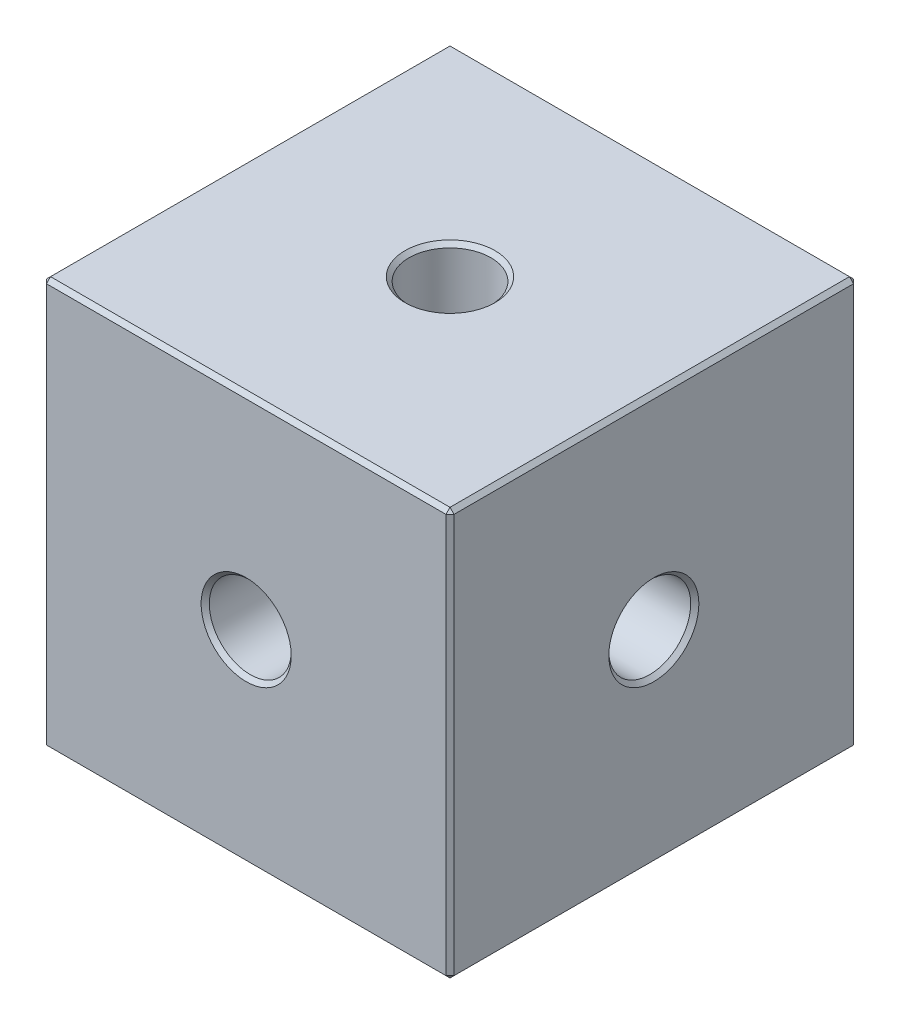
ISO-10303-21;
HEADER;
FILE_DESCRIPTION(('STEP AP214'),'2;1');
FILE_NAME('part.step','',(''),(''),'','','');
FILE_SCHEMA(('AUTOMOTIVE_DESIGN { 1 0 10303 214 1 1 1 1 }'));
ENDSEC;
DATA;
#1=APPLICATION_CONTEXT('core data for automotive mechanical design processes');
#2=APPLICATION_PROTOCOL_DEFINITION('international standard','automotive_design',2000,#1);
#3=PRODUCT_CONTEXT('',#1,'mechanical');
#4=PRODUCT('Part','Part','',(#3));
#5=PRODUCT_RELATED_PRODUCT_CATEGORY('part','',(#4));
#6=PRODUCT_DEFINITION_FORMATION('','',#4);
#7=PRODUCT_DEFINITION_CONTEXT('part definition',#1,'design');
#8=PRODUCT_DEFINITION('design','',#6,#7);
#9=PRODUCT_DEFINITION_SHAPE('','',#8);
#10=(LENGTH_UNIT() NAMED_UNIT(*) SI_UNIT(.MILLI.,.METRE.));
#11=(NAMED_UNIT(*) PLANE_ANGLE_UNIT() SI_UNIT($,.RADIAN.));
#12=(NAMED_UNIT(*) SI_UNIT($,.STERADIAN.) SOLID_ANGLE_UNIT());
#13=UNCERTAINTY_MEASURE_WITH_UNIT(LENGTH_MEASURE(1.E-05),#10,'distance_accuracy_value','');
#14=(GEOMETRIC_REPRESENTATION_CONTEXT(3) GLOBAL_UNCERTAINTY_ASSIGNED_CONTEXT((#13)) GLOBAL_UNIT_ASSIGNED_CONTEXT((#10,
#11,#12)) REPRESENTATION_CONTEXT('',''));
#15=CARTESIAN_POINT('',(0.,0.,0.));
#16=DIRECTION('',(0.,0.,1.));
#17=DIRECTION('',(1.,0.,0.));
#18=AXIS2_PLACEMENT_3D('',#15,#16,#17);
#19=CARTESIAN_POINT('',(-33.5101830116808,19.0472283906615,11.4440779123584));
#20=DIRECTION('',(1.,0.,0.));
#21=DIRECTION('',(0.,0.,-1.));
#22=AXIS2_PLACEMENT_3D('',#19,#20,#21);
#23=CYLINDRICAL_SURFACE('',#22,2.55269999999999);
#24=CARTESIAN_POINT('',(-33.7641830116808,19.0472283906615,11.4440779123584));
#25=DIRECTION('',(1.,0.,0.));
#26=DIRECTION('',(0.,0.,-1.));
#27=AXIS2_PLACEMENT_3D('',#24,#25,#26);
#28=CIRCLE('',#27,2.55269999999999);
#29=CARTESIAN_POINT('',(-33.7641830116808,19.0472283906615,8.89137791235836));
#30=VERTEX_POINT('',#29);
#31=EDGE_CURVE('E25',#30,#30,#28,.T.);
#32=ORIENTED_EDGE('',*,*,#31,.T.);
#33=EDGE_LOOP('',(#32));
#34=FACE_BOUND('',#33,.T.);
#35=CARTESIAN_POINT('',(-46.2101830116808,19.0472283906615,11.4440779123584));
#36=DIRECTION('',(0.707106781186547,-0.707106781186547,0.));
#37=DIRECTION('',(0.707106781186547,0.707106781186547,0.));
#38=AXIS2_PLACEMENT_3D('',#35,#36,#37);
#39=ELLIPSE('',#38,3.61006296066979,2.55269999999999);
#40=CARTESIAN_POINT('',(-44.4051515313459,20.8522598709964,13.2491093926932));
#41=VERTEX_POINT('',#40);
#42=CARTESIAN_POINT('',(-44.4051515313459,20.8522598709964,9.63904643202346));
#43=VERTEX_POINT('',#42);
#44=EDGE_CURVE('E152',#41,#43,#39,.F.);
#45=ORIENTED_EDGE('',*,*,#44,.T.);
#46=CARTESIAN_POINT('',(-46.2101830116808,19.0472283906615,11.4440779123584));
#47=DIRECTION('',(0.707106781186547,0.,0.707106781186547));
#48=DIRECTION('',(0.707106781186547,0.,-0.707106781186547));
#49=AXIS2_PLACEMENT_3D('',#46,#47,#48);
#50=ELLIPSE('',#49,3.61006296066979,2.55269999999999);
#51=CARTESIAN_POINT('',(-44.4051515313459,17.2421969103266,9.63904643202346));
#52=VERTEX_POINT('',#51);
#53=EDGE_CURVE('E136',#43,#52,#50,.F.);
#54=ORIENTED_EDGE('',*,*,#53,.T.);
#55=CARTESIAN_POINT('',(-46.2101830116808,19.0472283906615,11.4440779123584));
#56=DIRECTION('',(0.707106781186547,0.707106781186547,0.));
#57=DIRECTION('',(0.707106781186547,-0.707106781186547,0.));
#58=AXIS2_PLACEMENT_3D('',#55,#56,#57);
#59=ELLIPSE('',#58,3.61006296066979,2.55269999999999);
#60=CARTESIAN_POINT('',(-44.4051515313459,17.2421969103266,13.2491093926932));
#61=VERTEX_POINT('',#60);
#62=EDGE_CURVE('E145',#52,#61,#59,.F.);
#63=ORIENTED_EDGE('',*,*,#62,.T.);
#64=CARTESIAN_POINT('',(-46.2101830116808,19.0472283906615,11.4440779123584));
#65=DIRECTION('',(0.707106781186547,0.,-0.707106781186547));
#66=DIRECTION('',(0.707106781186547,0.,0.707106781186547));
#67=AXIS2_PLACEMENT_3D('',#64,#65,#66);
#68=ELLIPSE('',#67,3.61006296066979,2.55269999999999);
#69=EDGE_CURVE('E325',#61,#41,#68,.F.);
#70=ORIENTED_EDGE('',*,*,#69,.T.);
#71=EDGE_LOOP('',(#45,#54,#63,#70));
#72=FACE_BOUND('',#71,.T.);
#73=ADVANCED_FACE('F16',(#34,#72),#23,.F.);
#74=CARTESIAN_POINT('',(-58.9101830116808,6.34722839066153,24.1440779123584));
#75=DIRECTION('',(-1.,0.,0.));
#76=DIRECTION('',(0.,0.,1.));
#77=AXIS2_PLACEMENT_3D('',#74,#75,#76);
#78=PLANE('',#77);
#79=DIRECTION('',(0.,1.,0.));
#80=VECTOR('',#79,1.);
#81=CARTESIAN_POINT('',(-58.9101830116808,6.34722839066153,23.8900779123583));
#82=LINE('',#81,#80);
#83=CARTESIAN_POINT('',(-58.9101830116808,6.60122839066154,23.8900779123583));
#84=VERTEX_POINT('',#83);
#85=CARTESIAN_POINT('',(-58.9101830116808,31.4932283906615,23.8900779123583));
#86=VERTEX_POINT('',#85);
#87=EDGE_CURVE('E208',#84,#86,#82,.T.);
#88=ORIENTED_EDGE('',*,*,#87,.T.);
#89=DIRECTION('',(0.,0.,-1.));
#90=VECTOR('',#89,1.);
#91=CARTESIAN_POINT('',(-58.9101830116808,31.4932283906615,-1.25592208764165));
#92=LINE('',#91,#90);
#93=CARTESIAN_POINT('',(-58.9101830116808,31.4932283906615,-1.00192208764164));
#94=VERTEX_POINT('',#93);
#95=EDGE_CURVE('E210',#86,#94,#92,.T.);
#96=ORIENTED_EDGE('',*,*,#95,.T.);
#97=DIRECTION('',(0.,-1.,0.));
#98=VECTOR('',#97,1.);
#99=CARTESIAN_POINT('',(-58.9101830116808,6.34722839066153,-1.00192208764164));
#100=LINE('',#99,#98);
#101=CARTESIAN_POINT('',(-58.9101830116808,6.60122839066154,-1.00192208764164));
#102=VERTEX_POINT('',#101);
#103=EDGE_CURVE('E204',#94,#102,#100,.T.);
#104=ORIENTED_EDGE('',*,*,#103,.T.);
#105=DIRECTION('',(0.,0.,1.));
#106=VECTOR('',#105,1.);
#107=CARTESIAN_POINT('',(-58.9101830116808,6.60122839066154,24.1440779123584));
#108=LINE('',#107,#106);
#109=EDGE_CURVE('E206',#102,#84,#108,.T.);
#110=ORIENTED_EDGE('',*,*,#109,.T.);
#111=EDGE_LOOP('',(#88,#96,#104,#110));
#112=FACE_BOUND('',#111,.T.);
#113=CARTESIAN_POINT('',(-58.9101830116808,19.0472283906615,11.4440779123584));
#114=DIRECTION('',(-1.,0.,0.));
#115=DIRECTION('',(0.,0.,1.));
#116=AXIS2_PLACEMENT_3D('',#113,#114,#115);
#117=CIRCLE('',#116,2.80669999999999);
#118=CARTESIAN_POINT('',(-58.9101830116808,19.0472283906615,14.2507779123583));
#119=VERTEX_POINT('',#118);
#120=EDGE_CURVE('E201',#119,#119,#117,.F.);
#121=ORIENTED_EDGE('',*,*,#120,.T.);
#122=EDGE_LOOP('',(#121));
#123=FACE_BOUND('',#122,.T.);
#124=ADVANCED_FACE('F349',(#112,#123),#78,.T.);
#125=CARTESIAN_POINT('',(-58.9101830116808,6.34722839066153,-1.25592208764165));
#126=DIRECTION('',(0.,0.,-1.));
#127=DIRECTION('',(-1.,0.,0.));
#128=AXIS2_PLACEMENT_3D('',#125,#126,#127);
#129=PLANE('',#128);
#130=DIRECTION('',(1.,0.,0.));
#131=VECTOR('',#130,1.);
#132=CARTESIAN_POINT('',(-33.5101830116808,31.4932283906615,-1.25592208764165));
#133=LINE('',#132,#131);
#134=CARTESIAN_POINT('',(-58.6561830116808,31.4932283906615,-1.25592208764165));
#135=VERTEX_POINT('',#134);
#136=CARTESIAN_POINT('',(-33.7641830116808,31.4932283906615,-1.25592208764165));
#137=VERTEX_POINT('',#136);
#138=EDGE_CURVE('E196',#135,#137,#133,.T.);
#139=ORIENTED_EDGE('',*,*,#138,.T.);
#140=DIRECTION('',(0.,-1.,0.));
#141=VECTOR('',#140,1.);
#142=CARTESIAN_POINT('',(-33.7641830116808,6.34722839066153,-1.25592208764165));
#143=LINE('',#142,#141);
#144=CARTESIAN_POINT('',(-33.7641830116808,6.60122839066154,-1.25592208764165));
#145=VERTEX_POINT('',#144);
#146=EDGE_CURVE('E198',#137,#145,#143,.T.);
#147=ORIENTED_EDGE('',*,*,#146,.T.);
#148=DIRECTION('',(-1.,0.,0.));
#149=VECTOR('',#148,1.);
#150=CARTESIAN_POINT('',(-58.9101830116808,6.60122839066154,-1.25592208764165));
#151=LINE('',#150,#149);
#152=CARTESIAN_POINT('',(-58.6561830116808,6.60122839066154,-1.25592208764165));
#153=VERTEX_POINT('',#152);
#154=EDGE_CURVE('E192',#145,#153,#151,.T.);
#155=ORIENTED_EDGE('',*,*,#154,.T.);
#156=DIRECTION('',(0.,1.,0.));
#157=VECTOR('',#156,1.);
#158=CARTESIAN_POINT('',(-58.6561830116808,6.34722839066153,-1.25592208764165));
#159=LINE('',#158,#157);
#160=EDGE_CURVE('E194',#153,#135,#159,.T.);
#161=ORIENTED_EDGE('',*,*,#160,.T.);
#162=EDGE_LOOP('',(#139,#147,#155,#161));
#163=FACE_BOUND('',#162,.T.);
#164=CARTESIAN_POINT('',(-46.2101830116808,19.0472283906615,-1.25592208764165));
#165=DIRECTION('',(0.,0.,-1.));
#166=DIRECTION('',(-1.,0.,0.));
#167=AXIS2_PLACEMENT_3D('',#164,#165,#166);
#168=CIRCLE('',#167,2.8067);
#169=CARTESIAN_POINT('',(-49.0168830116808,19.0472283906615,-1.25592208764165));
#170=VERTEX_POINT('',#169);
#171=EDGE_CURVE('E189',#170,#170,#168,.F.);
#172=ORIENTED_EDGE('',*,*,#171,.T.);
#173=EDGE_LOOP('',(#172));
#174=FACE_BOUND('',#173,.T.);
#175=ADVANCED_FACE('F354',(#163,#174),#129,.T.);
#176=CARTESIAN_POINT('',(-33.5101830116808,6.34722839066153,24.1440779123584));
#177=DIRECTION('',(1.,0.,0.));
#178=DIRECTION('',(0.,0.,-1.));
#179=AXIS2_PLACEMENT_3D('',#176,#177,#178);
#180=PLANE('',#179);
#181=DIRECTION('',(0.,1.,0.));
#182=VECTOR('',#181,1.);
#183=CARTESIAN_POINT('',(-33.5101830116808,6.34722839066153,-1.00192208764164));
#184=LINE('',#183,#182);
#185=CARTESIAN_POINT('',(-33.5101830116808,6.60122839066154,-1.00192208764164));
#186=VERTEX_POINT('',#185);
#187=CARTESIAN_POINT('',(-33.5101830116808,31.4932283906615,-1.00192208764164));
#188=VERTEX_POINT('',#187);
#189=EDGE_CURVE('E184',#186,#188,#184,.T.);
#190=ORIENTED_EDGE('',*,*,#189,.T.);
#191=DIRECTION('',(0.,0.,1.));
#192=VECTOR('',#191,1.);
#193=CARTESIAN_POINT('',(-33.5101830116808,31.4932283906615,24.1440779123584));
#194=LINE('',#193,#192);
#195=CARTESIAN_POINT('',(-33.5101830116808,31.4932283906615,23.8900779123583));
#196=VERTEX_POINT('',#195);
#197=EDGE_CURVE('E186',#188,#196,#194,.T.);
#198=ORIENTED_EDGE('',*,*,#197,.T.);
#199=DIRECTION('',(0.,-1.,0.));
#200=VECTOR('',#199,1.);
#201=CARTESIAN_POINT('',(-33.5101830116808,6.34722839066153,23.8900779123583));
#202=LINE('',#201,#200);
#203=CARTESIAN_POINT('',(-33.5101830116808,6.60122839066154,23.8900779123583));
#204=VERTEX_POINT('',#203);
#205=EDGE_CURVE('E182',#196,#204,#202,.T.);
#206=ORIENTED_EDGE('',*,*,#205,.T.);
#207=DIRECTION('',(0.,0.,-1.));
#208=VECTOR('',#207,1.);
#209=CARTESIAN_POINT('',(-33.5101830116808,6.60122839066154,24.1440779123584));
#210=LINE('',#209,#208);
#211=EDGE_CURVE('E180',#204,#186,#210,.T.);
#212=ORIENTED_EDGE('',*,*,#211,.T.);
#213=EDGE_LOOP('',(#190,#198,#206,#212));
#214=FACE_BOUND('',#213,.T.);
#215=CARTESIAN_POINT('',(-33.5101830116808,19.0472283906615,11.4440779123584));
#216=DIRECTION('',(1.,0.,0.));
#217=DIRECTION('',(0.,0.,-1.));
#218=AXIS2_PLACEMENT_3D('',#215,#216,#217);
#219=CIRCLE('',#218,2.80669999999998);
#220=CARTESIAN_POINT('',(-33.5101830116808,19.0472283906615,8.63737791235837));
#221=VERTEX_POINT('',#220);
#222=EDGE_CURVE('E177',#221,#221,#219,.F.);
#223=ORIENTED_EDGE('',*,*,#222,.T.);
#224=EDGE_LOOP('',(#223));
#225=FACE_BOUND('',#224,.T.);
#226=ADVANCED_FACE('F367',(#214,#225),#180,.T.);
#227=CARTESIAN_POINT('',(-58.9101830116808,6.34722839066153,24.1440779123584));
#228=DIRECTION('',(0.,0.,1.));
#229=DIRECTION('',(1.,0.,0.));
#230=AXIS2_PLACEMENT_3D('',#227,#228,#229);
#231=PLANE('',#230);
#232=DIRECTION('',(0.,1.,0.));
#233=VECTOR('',#232,1.);
#234=CARTESIAN_POINT('',(-33.7641830116808,6.34722839066153,24.1440779123584));
#235=LINE('',#234,#233);
#236=CARTESIAN_POINT('',(-33.7641830116808,6.60122839066154,24.1440779123584));
#237=VERTEX_POINT('',#236);
#238=CARTESIAN_POINT('',(-33.7641830116808,31.4932283906615,24.1440779123584));
#239=VERTEX_POINT('',#238);
#240=EDGE_CURVE('E220',#237,#239,#235,.T.);
#241=ORIENTED_EDGE('',*,*,#240,.T.);
#242=DIRECTION('',(-1.,0.,0.));
#243=VECTOR('',#242,1.);
#244=CARTESIAN_POINT('',(-58.9101830116808,31.4932283906615,24.1440779123584));
#245=LINE('',#244,#243);
#246=CARTESIAN_POINT('',(-58.6561830116808,31.4932283906615,24.1440779123584));
#247=VERTEX_POINT('',#246);
#248=EDGE_CURVE('E222',#239,#247,#245,.T.);
#249=ORIENTED_EDGE('',*,*,#248,.T.);
#250=DIRECTION('',(0.,-1.,0.));
#251=VECTOR('',#250,1.);
#252=CARTESIAN_POINT('',(-58.6561830116808,6.34722839066153,24.1440779123584));
#253=LINE('',#252,#251);
#254=CARTESIAN_POINT('',(-58.6561830116808,6.60122839066154,24.1440779123584));
#255=VERTEX_POINT('',#254);
#256=EDGE_CURVE('E216',#247,#255,#253,.T.);
#257=ORIENTED_EDGE('',*,*,#256,.T.);
#258=DIRECTION('',(1.,0.,0.));
#259=VECTOR('',#258,1.);
#260=CARTESIAN_POINT('',(-58.9101830116808,6.60122839066154,24.1440779123584));
#261=LINE('',#260,#259);
#262=EDGE_CURVE('E218',#255,#237,#261,.T.);
#263=ORIENTED_EDGE('',*,*,#262,.T.);
#264=EDGE_LOOP('',(#241,#249,#257,#263));
#265=FACE_BOUND('',#264,.T.);
#266=CARTESIAN_POINT('',(-46.2101830116808,19.0472283906615,24.1440779123584));
#267=DIRECTION('',(0.,0.,1.));
#268=DIRECTION('',(1.,0.,0.));
#269=AXIS2_PLACEMENT_3D('',#266,#267,#268);
#270=CIRCLE('',#269,2.80669999999999);
#271=CARTESIAN_POINT('',(-43.4034830116808,19.0472283906615,24.1440779123584));
#272=VERTEX_POINT('',#271);
#273=EDGE_CURVE('E213',#272,#272,#270,.F.);
#274=ORIENTED_EDGE('',*,*,#273,.T.);
#275=EDGE_LOOP('',(#274));
#276=FACE_BOUND('',#275,.T.);
#277=ADVANCED_FACE('F361',(#265,#276),#231,.T.);
#278=CARTESIAN_POINT('',(-58.9101830116808,6.34722839066153,-1.25592208764165));
#279=DIRECTION('',(0.,-1.,0.));
#280=DIRECTION('',(0.,0.,-1.));
#281=AXIS2_PLACEMENT_3D('',#278,#279,#280);
#282=PLANE('',#281);
#283=DIRECTION('',(1.,0.,0.));
#284=VECTOR('',#283,1.);
#285=CARTESIAN_POINT('',(-58.9101830116808,6.34722839066153,-1.00192208764164));
#286=LINE('',#285,#284);
#287=CARTESIAN_POINT('',(-58.6561830116808,6.34722839066153,-1.00192208764164));
#288=VERTEX_POINT('',#287);
#289=CARTESIAN_POINT('',(-33.7641830116808,6.34722839066153,-1.00192208764164));
#290=VERTEX_POINT('',#289);
#291=EDGE_CURVE('E228',#288,#290,#286,.T.);
#292=ORIENTED_EDGE('',*,*,#291,.T.);
#293=DIRECTION('',(0.,0.,1.));
#294=VECTOR('',#293,1.);
#295=CARTESIAN_POINT('',(-33.7641830116808,6.34722839066153,-1.25592208764165));
#296=LINE('',#295,#294);
#297=CARTESIAN_POINT('',(-33.7641830116808,6.34722839066153,23.8900779123583));
#298=VERTEX_POINT('',#297);
#299=EDGE_CURVE('E233',#290,#298,#296,.T.);
#300=ORIENTED_EDGE('',*,*,#299,.T.);
#301=DIRECTION('',(-1.,0.,0.));
#302=VECTOR('',#301,1.);
#303=CARTESIAN_POINT('',(-58.9101830116808,6.34722839066153,23.8900779123583));
#304=LINE('',#303,#302);
#305=CARTESIAN_POINT('',(-58.6561830116808,6.34722839066153,23.8900779123583));
#306=VERTEX_POINT('',#305);
#307=EDGE_CURVE('E41',#298,#306,#304,.T.);
#308=ORIENTED_EDGE('',*,*,#307,.T.);
#309=DIRECTION('',(0.,0.,-1.));
#310=VECTOR('',#309,1.);
#311=CARTESIAN_POINT('',(-58.6561830116808,6.34722839066153,-1.25592208764165));
#312=LINE('',#311,#310);
#313=EDGE_CURVE('E230',#306,#288,#312,.T.);
#314=ORIENTED_EDGE('',*,*,#313,.T.);
#315=EDGE_LOOP('',(#292,#300,#308,#314));
#316=FACE_BOUND('',#315,.T.);
#317=CARTESIAN_POINT('',(-46.2101830116808,6.34722839066153,11.4440779123584));
#318=DIRECTION('',(0.,-1.,0.));
#319=DIRECTION('',(0.,0.,-1.));
#320=AXIS2_PLACEMENT_3D('',#317,#318,#319);
#321=CIRCLE('',#320,2.8067);
#322=CARTESIAN_POINT('',(-46.2101830116808,6.34722839066153,8.63737791235835));
#323=VERTEX_POINT('',#322);
#324=EDGE_CURVE('E225',#323,#323,#321,.F.);
#325=ORIENTED_EDGE('',*,*,#324,.T.);
#326=EDGE_LOOP('',(#325));
#327=FACE_BOUND('',#326,.T.);
#328=ADVANCED_FACE('F358',(#316,#327),#282,.T.);
#329=CARTESIAN_POINT('',(-58.9101830116808,31.7472283906615,-1.25592208764165));
#330=DIRECTION('',(0.,-1.,0.));
#331=DIRECTION('',(0.,0.,-1.));
#332=AXIS2_PLACEMENT_3D('',#329,#330,#331);
#333=PLANE('',#332);
#334=DIRECTION('',(1.,0.,0.));
#335=VECTOR('',#334,1.);
#336=CARTESIAN_POINT('',(-33.5101830116808,31.7472283906615,23.8900779123583));
#337=LINE('',#336,#335);
#338=CARTESIAN_POINT('',(-58.6561830116808,31.7472283906615,23.8900779123583));
#339=VERTEX_POINT('',#338);
#340=CARTESIAN_POINT('',(-33.7641830116808,31.7472283906615,23.8900779123583));
#341=VERTEX_POINT('',#340);
#342=EDGE_CURVE('E168',#339,#341,#337,.T.);
#343=ORIENTED_EDGE('',*,*,#342,.T.);
#344=DIRECTION('',(0.,0.,-1.));
#345=VECTOR('',#344,1.);
#346=CARTESIAN_POINT('',(-33.7641830116808,31.7472283906615,-1.25592208764165));
#347=LINE('',#346,#345);
#348=CARTESIAN_POINT('',(-33.7641830116808,31.7472283906615,-1.00192208764164));
#349=VERTEX_POINT('',#348);
#350=EDGE_CURVE('E174',#341,#349,#347,.T.);
#351=ORIENTED_EDGE('',*,*,#350,.T.);
#352=DIRECTION('',(-1.,0.,0.));
#353=VECTOR('',#352,1.);
#354=CARTESIAN_POINT('',(-58.9101830116808,31.7472283906615,-1.00192208764164));
#355=LINE('',#354,#353);
#356=CARTESIAN_POINT('',(-58.6561830116808,31.7472283906615,-1.00192208764164));
#357=VERTEX_POINT('',#356);
#358=EDGE_CURVE('E172',#349,#357,#355,.T.);
#359=ORIENTED_EDGE('',*,*,#358,.T.);
#360=DIRECTION('',(0.,0.,1.));
#361=VECTOR('',#360,1.);
#362=CARTESIAN_POINT('',(-58.6561830116808,31.7472283906615,24.1440779123584));
#363=LINE('',#362,#361);
#364=EDGE_CURVE('E170',#357,#339,#363,.T.);
#365=ORIENTED_EDGE('',*,*,#364,.T.);
#366=EDGE_LOOP('',(#343,#351,#359,#365));
#367=FACE_BOUND('',#366,.T.);
#368=CARTESIAN_POINT('',(-46.2101830116808,31.7472283906615,11.4440779123584));
#369=DIRECTION('',(0.,-1.,0.));
#370=DIRECTION('',(0.,0.,-1.));
#371=AXIS2_PLACEMENT_3D('',#368,#369,#370);
#372=CIRCLE('',#371,2.80669999999998);
#373=CARTESIAN_POINT('',(-46.2101830116808,31.7472283906615,8.63737791235837));
#374=VERTEX_POINT('',#373);
#375=EDGE_CURVE('E165',#374,#374,#372,.T.);
#376=ORIENTED_EDGE('',*,*,#375,.T.);
#377=EDGE_LOOP('',(#376));
#378=FACE_BOUND('',#377,.T.);
#379=ADVANCED_FACE('F344',(#367,#378),#333,.F.);
#380=CARTESIAN_POINT('',(-58.6561830116808,19.0472283906615,11.4440779123584));
#381=DIRECTION('',(-1.,0.,0.));
#382=DIRECTION('',(0.,0.,1.));
#383=AXIS2_PLACEMENT_3D('',#380,#381,#382);
#384=CIRCLE('',#383,2.55269999999999);
#385=CARTESIAN_POINT('',(-58.6561830116808,19.0472283906615,13.9967779123583));
#386=VERTEX_POINT('',#385);
#387=EDGE_CURVE('E235',#386,#386,#384,.T.);
#388=ORIENTED_EDGE('',*,*,#387,.T.);
#389=EDGE_LOOP('',(#388));
#390=FACE_BOUND('',#389,.T.);
#391=CARTESIAN_POINT('',(-46.2101830116808,19.0472283906615,11.4440779123584));
#392=DIRECTION('',(0.707106781186547,0.707106781186547,0.));
#393=DIRECTION('',(0.707106781186547,-0.707106781186547,0.));
#394=AXIS2_PLACEMENT_3D('',#391,#392,#393);
#395=ELLIPSE('',#394,3.61006296066979,2.55269999999999);
#396=CARTESIAN_POINT('',(-48.0152144920157,20.8522598709964,9.63904643202346));
#397=VERTEX_POINT('',#396);
#398=CARTESIAN_POINT('',(-48.0152144920157,20.8522598709964,13.2491093926932));
#399=VERTEX_POINT('',#398);
#400=EDGE_CURVE('E157',#397,#399,#395,.T.);
#401=ORIENTED_EDGE('',*,*,#400,.T.);
#402=CARTESIAN_POINT('',(-46.2101830116808,19.0472283906615,11.4440779123584));
#403=DIRECTION('',(0.707106781186547,0.,0.707106781186547));
#404=DIRECTION('',(0.707106781186547,0.,-0.707106781186547));
#405=AXIS2_PLACEMENT_3D('',#402,#403,#404);
#406=ELLIPSE('',#405,3.61006296066979,2.55269999999999);
#407=CARTESIAN_POINT('',(-48.0152144920157,17.2421969103266,13.2491093926932));
#408=VERTEX_POINT('',#407);
#409=EDGE_CURVE('E322',#399,#408,#406,.T.);
#410=ORIENTED_EDGE('',*,*,#409,.T.);
#411=CARTESIAN_POINT('',(-46.2101830116808,19.0472283906615,11.4440779123584));
#412=DIRECTION('',(0.707106781186547,-0.707106781186547,0.));
#413=DIRECTION('',(0.707106781186547,0.707106781186547,0.));
#414=AXIS2_PLACEMENT_3D('',#411,#412,#413);
#415=ELLIPSE('',#414,3.61006296066979,2.55269999999999);
#416=CARTESIAN_POINT('',(-48.0152144920157,17.2421969103266,9.63904643202346));
#417=VERTEX_POINT('',#416);
#418=EDGE_CURVE('E160',#408,#417,#415,.T.);
#419=ORIENTED_EDGE('',*,*,#418,.T.);
#420=CARTESIAN_POINT('',(-46.2101830116808,19.0472283906615,11.4440779123584));
#421=DIRECTION('',(0.707106781186547,0.,-0.707106781186547));
#422=DIRECTION('',(0.707106781186547,0.,0.707106781186547));
#423=AXIS2_PLACEMENT_3D('',#420,#421,#422);
#424=ELLIPSE('',#423,3.61006296066979,2.55269999999999);
#425=EDGE_CURVE('E139',#417,#397,#424,.T.);
#426=ORIENTED_EDGE('',*,*,#425,.T.);
#427=EDGE_LOOP('',(#401,#410,#419,#426));
#428=FACE_BOUND('',#427,.T.);
#429=ADVANCED_FACE('F330',(#390,#428),#23,.F.);
#430=CARTESIAN_POINT('',(-46.2101830116808,31.7472283906615,11.4440779123584));
#431=DIRECTION('',(0.,1.,0.));
#432=DIRECTION('',(0.,0.,1.));
#433=AXIS2_PLACEMENT_3D('',#430,#431,#432);
#434=CYLINDRICAL_SURFACE('',#433,2.55269999999999);
#435=CARTESIAN_POINT('',(-46.2101830116808,31.4932283906615,11.4440779123584));
#436=DIRECTION('',(0.,-1.,0.));
#437=DIRECTION('',(0.,0.,-1.));
#438=AXIS2_PLACEMENT_3D('',#435,#436,#437);
#439=CIRCLE('',#438,2.55269999999999);
#440=CARTESIAN_POINT('',(-46.2101830116808,31.4932283906615,8.89137791235836));
#441=VERTEX_POINT('',#440);
#442=EDGE_CURVE('E10',#441,#441,#439,.F.);
#443=ORIENTED_EDGE('',*,*,#442,.T.);
#444=EDGE_LOOP('',(#443));
#445=FACE_BOUND('',#444,.T.);
#446=ORIENTED_EDGE('',*,*,#400,.F.);
#447=CARTESIAN_POINT('',(-46.2101830116808,19.0472283906615,11.4440779123584));
#448=DIRECTION('',(0.,0.707106781186547,0.707106781186547));
#449=DIRECTION('',(0.,0.707106781186547,-0.707106781186547));
#450=AXIS2_PLACEMENT_3D('',#447,#448,#449);
#451=ELLIPSE('',#450,3.61006296066979,2.55269999999999);
#452=EDGE_CURVE('E153',#397,#43,#451,.F.);
#453=ORIENTED_EDGE('',*,*,#452,.T.);
#454=ORIENTED_EDGE('',*,*,#44,.F.);
#455=CARTESIAN_POINT('',(-46.2101830116808,19.0472283906615,11.4440779123584));
#456=DIRECTION('',(0.,0.707106781186547,-0.707106781186547));
#457=DIRECTION('',(0.,0.707106781186547,0.707106781186547));
#458=AXIS2_PLACEMENT_3D('',#455,#456,#457);
#459=ELLIPSE('',#458,3.61006296066979,2.55269999999999);
#460=EDGE_CURVE('E327',#41,#399,#459,.F.);
#461=ORIENTED_EDGE('',*,*,#460,.T.);
#462=EDGE_LOOP('',(#446,#453,#454,#461));
#463=FACE_BOUND('',#462,.T.);
#464=ADVANCED_FACE('F334',(#445,#463),#434,.F.);
#465=CARTESIAN_POINT('',(-46.2101830116808,6.60122839066155,11.4440779123584));
#466=DIRECTION('',(0.,-1.,0.));
#467=DIRECTION('',(0.,0.,-1.));
#468=AXIS2_PLACEMENT_3D('',#465,#466,#467);
#469=CIRCLE('',#468,2.55269999999999);
#470=CARTESIAN_POINT('',(-46.2101830116808,6.60122839066155,8.89137791235836));
#471=VERTEX_POINT('',#470);
#472=EDGE_CURVE('E241',#471,#471,#469,.T.);
#473=ORIENTED_EDGE('',*,*,#472,.T.);
#474=EDGE_LOOP('',(#473));
#475=FACE_BOUND('',#474,.T.);
#476=ORIENTED_EDGE('',*,*,#418,.F.);
#477=CARTESIAN_POINT('',(-46.2101830116808,19.0472283906615,11.4440779123584));
#478=DIRECTION('',(0.,0.707106781186547,0.707106781186547));
#479=DIRECTION('',(0.,0.707106781186547,-0.707106781186547));
#480=AXIS2_PLACEMENT_3D('',#477,#478,#479);
#481=ELLIPSE('',#480,3.61006296066979,2.55269999999999);
#482=EDGE_CURVE('E144',#408,#61,#481,.T.);
#483=ORIENTED_EDGE('',*,*,#482,.T.);
#484=ORIENTED_EDGE('',*,*,#62,.F.);
#485=CARTESIAN_POINT('',(-46.2101830116808,19.0472283906615,11.4440779123584));
#486=DIRECTION('',(0.,0.707106781186547,-0.707106781186547));
#487=DIRECTION('',(0.,0.707106781186547,0.707106781186547));
#488=AXIS2_PLACEMENT_3D('',#485,#486,#487);
#489=ELLIPSE('',#488,3.61006296066979,2.55269999999999);
#490=EDGE_CURVE('E133',#52,#417,#489,.T.);
#491=ORIENTED_EDGE('',*,*,#490,.T.);
#492=EDGE_LOOP('',(#476,#483,#484,#491));
#493=FACE_BOUND('',#492,.T.);
#494=ADVANCED_FACE('F156',(#475,#493),#434,.F.);
#495=CARTESIAN_POINT('',(-46.2101830116808,19.0472283906615,24.1440779123584));
#496=DIRECTION('',(0.,0.,1.));
#497=DIRECTION('',(1.,0.,0.));
#498=AXIS2_PLACEMENT_3D('',#495,#496,#497);
#499=CYLINDRICAL_SURFACE('',#498,2.55269999999999);
#500=CARTESIAN_POINT('',(-46.2101830116808,19.0472283906615,23.8900779123583));
#501=DIRECTION('',(0.,0.,1.));
#502=DIRECTION('',(1.,0.,0.));
#503=AXIS2_PLACEMENT_3D('',#500,#501,#502);
#504=CIRCLE('',#503,2.55269999999999);
#505=CARTESIAN_POINT('',(-43.6574830116808,19.0472283906615,23.8900779123583));
#506=VERTEX_POINT('',#505);
#507=EDGE_CURVE('E238',#506,#506,#504,.T.);
#508=ORIENTED_EDGE('',*,*,#507,.T.);
#509=EDGE_LOOP('',(#508));
#510=FACE_BOUND('',#509,.T.);
#511=ORIENTED_EDGE('',*,*,#69,.F.);
#512=ORIENTED_EDGE('',*,*,#482,.F.);
#513=ORIENTED_EDGE('',*,*,#409,.F.);
#514=ORIENTED_EDGE('',*,*,#460,.F.);
#515=EDGE_LOOP('',(#511,#512,#513,#514));
#516=FACE_BOUND('',#515,.T.);
#517=ADVANCED_FACE('F332',(#510,#516),#499,.F.);
#518=CARTESIAN_POINT('',(-46.2101830116808,19.0472283906615,-1.00192208764164));
#519=DIRECTION('',(0.,0.,-1.));
#520=DIRECTION('',(-1.,0.,0.));
#521=AXIS2_PLACEMENT_3D('',#518,#519,#520);
#522=CIRCLE('',#521,2.55269999999999);
#523=CARTESIAN_POINT('',(-48.7628830116808,19.0472283906615,-1.00192208764164));
#524=VERTEX_POINT('',#523);
#525=EDGE_CURVE('E244',#524,#524,#522,.T.);
#526=ORIENTED_EDGE('',*,*,#525,.T.);
#527=EDGE_LOOP('',(#526));
#528=FACE_BOUND('',#527,.T.);
#529=ORIENTED_EDGE('',*,*,#425,.F.);
#530=ORIENTED_EDGE('',*,*,#490,.F.);
#531=ORIENTED_EDGE('',*,*,#53,.F.);
#532=ORIENTED_EDGE('',*,*,#452,.F.);
#533=EDGE_LOOP('',(#529,#530,#531,#532));
#534=FACE_BOUND('',#533,.T.);
#535=ADVANCED_FACE('F135',(#528,#534),#499,.F.);
#536=CARTESIAN_POINT('',(-58.9101830116808,6.60122839066154,24.1440779123584));
#537=DIRECTION('',(0.707106781186547,0.707106781186547,0.));
#538=DIRECTION('',(-0.707106781186548,0.707106781186548,0.));
#539=AXIS2_PLACEMENT_3D('',#536,#537,#538);
#540=PLANE('',#539);
#541=DIRECTION('',(-0.707106781186547,0.707106781186547,0.));
#542=VECTOR('',#541,1.);
#543=CARTESIAN_POINT('',(-58.6561830116808,6.34722839066153,23.8900779123583));
#544=LINE('',#543,#542);
#545=EDGE_CURVE('E20',#84,#306,#544,.F.);
#546=ORIENTED_EDGE('',*,*,#545,.F.);
#547=ORIENTED_EDGE('',*,*,#109,.F.);
#548=DIRECTION('',(0.707106781186547,-0.707106781186547,0.));
#549=VECTOR('',#548,1.);
#550=CARTESIAN_POINT('',(-58.6561830116808,6.34722839066153,-1.00192208764164));
#551=LINE('',#550,#549);
#552=EDGE_CURVE('E306',#288,#102,#551,.F.);
#553=ORIENTED_EDGE('',*,*,#552,.F.);
#554=ORIENTED_EDGE('',*,*,#313,.F.);
#555=EDGE_LOOP('',(#546,#547,#553,#554));
#556=FACE_BOUND('',#555,.T.);
#557=ADVANCED_FACE('F449',(#556),#540,.F.);
#558=CARTESIAN_POINT('',(-58.6561830116808,6.34722839066153,23.8900779123583));
#559=DIRECTION('',(-0.577350269189626,-0.577350269189626,0.577350269189626));
#560=DIRECTION('',(0.707106781186547,0.,0.707106781186547));
#561=AXIS2_PLACEMENT_3D('',#558,#559,#560);
#562=PLANE('',#561);
#563=DIRECTION('',(0.707106781186547,0.,0.707106781186547));
#564=VECTOR('',#563,1.);
#565=CARTESIAN_POINT('',(-58.7831830116808,6.60122839066154,24.0170779123583));
#566=LINE('',#565,#564);
#567=EDGE_CURVE('E301',#84,#255,#566,.T.);
#568=ORIENTED_EDGE('',*,*,#567,.F.);
#569=ORIENTED_EDGE('',*,*,#545,.T.);
#570=DIRECTION('',(0.,-0.707106781186547,-0.707106781186547));
#571=VECTOR('',#570,1.);
#572=CARTESIAN_POINT('',(-58.6561830116808,6.34722839066153,23.8900779123583));
#573=LINE('',#572,#571);
#574=EDGE_CURVE('E304',#255,#306,#573,.T.);
#575=ORIENTED_EDGE('',*,*,#574,.F.);
#576=EDGE_LOOP('',(#568,#569,#575));
#577=FACE_BOUND('',#576,.T.);
#578=ADVANCED_FACE('F446',(#577),#562,.T.);
#579=CARTESIAN_POINT('',(-58.6561830116808,6.34722839066153,-1.00192208764164));
#580=DIRECTION('',(-0.577350269189626,-0.577350269189626,-0.577350269189626));
#581=DIRECTION('',(-0.707106781186547,0.,0.707106781186547));
#582=AXIS2_PLACEMENT_3D('',#579,#580,#581);
#583=PLANE('',#582);
#584=DIRECTION('',(0.,0.707106781186547,-0.707106781186547));
#585=VECTOR('',#584,1.);
#586=CARTESIAN_POINT('',(-58.6561830116808,6.34722839066153,-1.00192208764164));
#587=LINE('',#586,#585);
#588=EDGE_CURVE('E295',#288,#153,#587,.T.);
#589=ORIENTED_EDGE('',*,*,#588,.F.);
#590=ORIENTED_EDGE('',*,*,#552,.T.);
#591=DIRECTION('',(-0.707106781186547,0.,0.707106781186547));
#592=VECTOR('',#591,1.);
#593=CARTESIAN_POINT('',(-58.7831830116808,6.60122839066154,-1.12892208764164));
#594=LINE('',#593,#592);
#595=EDGE_CURVE('E298',#153,#102,#594,.T.);
#596=ORIENTED_EDGE('',*,*,#595,.F.);
#597=EDGE_LOOP('',(#589,#590,#596));
#598=FACE_BOUND('',#597,.T.);
#599=ADVANCED_FACE('F442',(#598),#583,.T.);
#600=CARTESIAN_POINT('',(-58.9101830116808,6.60122839066154,24.1440779123584));
#601=DIRECTION('',(0.,0.707106781186547,-0.707106781186547));
#602=DIRECTION('',(0.,0.707106781186548,0.707106781186548));
#603=AXIS2_PLACEMENT_3D('',#600,#601,#602);
#604=PLANE('',#603);
#605=ORIENTED_EDGE('',*,*,#574,.T.);
#606=ORIENTED_EDGE('',*,*,#307,.F.);
#607=DIRECTION('',(0.,0.707106781186547,0.707106781186547));
#608=VECTOR('',#607,1.);
#609=CARTESIAN_POINT('',(-33.7641830116808,6.47422839066154,24.0170779123583));
#610=LINE('',#609,#608);
#611=EDGE_CURVE('E33',#237,#298,#610,.F.);
#612=ORIENTED_EDGE('',*,*,#611,.F.);
#613=ORIENTED_EDGE('',*,*,#262,.F.);
#614=EDGE_LOOP('',(#605,#606,#612,#613));
#615=FACE_BOUND('',#614,.T.);
#616=ADVANCED_FACE('F438',(#615),#604,.F.);
#617=CARTESIAN_POINT('',(-58.9101830116808,6.34722839066153,23.8900779123583));
#618=DIRECTION('',(0.707106781186547,0.,-0.707106781186547));
#619=DIRECTION('',(-0.707106781186548,0.,-0.707106781186548));
#620=AXIS2_PLACEMENT_3D('',#617,#618,#619);
#621=PLANE('',#620);
#622=ORIENTED_EDGE('',*,*,#567,.T.);
#623=ORIENTED_EDGE('',*,*,#256,.F.);
#624=DIRECTION('',(-0.707106781186547,0.,-0.707106781186547));
#625=VECTOR('',#624,1.);
#626=CARTESIAN_POINT('',(-58.7831830116808,31.4932283906615,24.0170779123583));
#627=LINE('',#626,#625);
#628=EDGE_CURVE('E289',#86,#247,#627,.F.);
#629=ORIENTED_EDGE('',*,*,#628,.F.);
#630=ORIENTED_EDGE('',*,*,#87,.F.);
#631=EDGE_LOOP('',(#622,#623,#629,#630));
#632=FACE_BOUND('',#631,.T.);
#633=ADVANCED_FACE('F434',(#632),#621,.F.);
#634=CARTESIAN_POINT('',(-58.6561830116808,31.7472283906615,-1.25592208764165));
#635=DIRECTION('',(-0.707106781186547,0.707106781186547,0.));
#636=DIRECTION('',(-0.707106781186548,-0.707106781186548,0.));
#637=AXIS2_PLACEMENT_3D('',#634,#635,#636);
#638=PLANE('',#637);
#639=DIRECTION('',(0.707106781186547,0.707106781186547,0.));
#640=VECTOR('',#639,1.);
#641=CARTESIAN_POINT('',(-58.6561830116808,31.7472283906615,-1.00192208764164));
#642=LINE('',#641,#640);
#643=EDGE_CURVE('E283',#94,#357,#642,.T.);
#644=ORIENTED_EDGE('',*,*,#643,.F.);
#645=ORIENTED_EDGE('',*,*,#95,.F.);
#646=DIRECTION('',(-0.707106781186547,-0.707106781186547,0.));
#647=VECTOR('',#646,1.);
#648=CARTESIAN_POINT('',(-58.6561830116808,31.7472283906615,23.8900779123583));
#649=LINE('',#648,#647);
#650=EDGE_CURVE('E286',#339,#86,#649,.T.);
#651=ORIENTED_EDGE('',*,*,#650,.F.);
#652=ORIENTED_EDGE('',*,*,#364,.F.);
#653=EDGE_LOOP('',(#644,#645,#651,#652));
#654=FACE_BOUND('',#653,.T.);
#655=ADVANCED_FACE('F430',(#654),#638,.T.);
#656=CARTESIAN_POINT('',(-58.6561830116808,6.34722839066153,-1.25592208764165));
#657=DIRECTION('',(0.707106781186547,0.,0.707106781186547));
#658=DIRECTION('',(0.707106781186548,0.,-0.707106781186548));
#659=AXIS2_PLACEMENT_3D('',#656,#657,#658);
#660=PLANE('',#659);
#661=ORIENTED_EDGE('',*,*,#595,.T.);
#662=ORIENTED_EDGE('',*,*,#103,.F.);
#663=DIRECTION('',(0.707106781186547,0.,-0.707106781186547));
#664=VECTOR('',#663,1.);
#665=CARTESIAN_POINT('',(-58.7831830116808,31.4932283906615,-1.12892208764164));
#666=LINE('',#665,#664);
#667=EDGE_CURVE('E281',#135,#94,#666,.F.);
#668=ORIENTED_EDGE('',*,*,#667,.F.);
#669=ORIENTED_EDGE('',*,*,#160,.F.);
#670=EDGE_LOOP('',(#661,#662,#668,#669));
#671=FACE_BOUND('',#670,.T.);
#672=ADVANCED_FACE('F426',(#671),#660,.F.);
#673=CARTESIAN_POINT('',(-58.9101830116808,6.60122839066154,-1.25592208764165));
#674=DIRECTION('',(0.,0.707106781186547,0.707106781186547));
#675=DIRECTION('',(0.,-0.707106781186548,0.707106781186548));
#676=AXIS2_PLACEMENT_3D('',#673,#674,#675);
#677=PLANE('',#676);
#678=ORIENTED_EDGE('',*,*,#588,.T.);
#679=ORIENTED_EDGE('',*,*,#154,.F.);
#680=DIRECTION('',(0.,-0.707106781186547,0.707106781186547));
#681=VECTOR('',#680,1.);
#682=CARTESIAN_POINT('',(-33.7641830116808,6.60122839066154,-1.25592208764165));
#683=LINE('',#682,#681);
#684=EDGE_CURVE('E278',#290,#145,#683,.F.);
#685=ORIENTED_EDGE('',*,*,#684,.F.);
#686=ORIENTED_EDGE('',*,*,#291,.F.);
#687=EDGE_LOOP('',(#678,#679,#685,#686));
#688=FACE_BOUND('',#687,.T.);
#689=ADVANCED_FACE('F422',(#688),#677,.F.);
#690=CARTESIAN_POINT('',(-33.5101830116808,6.60122839066154,24.1440779123584));
#691=DIRECTION('',(-0.707106781186547,0.707106781186547,0.));
#692=DIRECTION('',(-0.707106781186548,-0.707106781186548,0.));
#693=AXIS2_PLACEMENT_3D('',#690,#691,#692);
#694=PLANE('',#693);
#695=DIRECTION('',(-0.707106781186547,-0.707106781186547,0.));
#696=VECTOR('',#695,1.);
#697=CARTESIAN_POINT('',(-33.5101830116808,6.60122839066154,23.8900779123583));
#698=LINE('',#697,#696);
#699=EDGE_CURVE('E293',#298,#204,#698,.F.);
#700=ORIENTED_EDGE('',*,*,#699,.F.);
#701=ORIENTED_EDGE('',*,*,#299,.F.);
#702=DIRECTION('',(0.707106781186547,0.707106781186547,0.));
#703=VECTOR('',#702,1.);
#704=CARTESIAN_POINT('',(-33.6371830116808,6.47422839066154,-1.00192208764164));
#705=LINE('',#704,#703);
#706=EDGE_CURVE('E275',#186,#290,#705,.F.);
#707=ORIENTED_EDGE('',*,*,#706,.F.);
#708=ORIENTED_EDGE('',*,*,#211,.F.);
#709=EDGE_LOOP('',(#700,#701,#707,#708));
#710=FACE_BOUND('',#709,.T.);
#711=ADVANCED_FACE('F419',(#710),#694,.F.);
#712=CARTESIAN_POINT('',(-33.5101830116808,6.60122839066154,23.8900779123583));
#713=DIRECTION('',(0.577350269189626,-0.577350269189626,0.577350269189626));
#714=DIRECTION('',(0.707106781186547,0.,-0.707106781186547));
#715=AXIS2_PLACEMENT_3D('',#712,#713,#714);
#716=PLANE('',#715);
#717=ORIENTED_EDGE('',*,*,#611,.T.);
#718=ORIENTED_EDGE('',*,*,#699,.T.);
#719=DIRECTION('',(0.707106781186547,0.,-0.707106781186547));
#720=VECTOR('',#719,1.);
#721=CARTESIAN_POINT('',(-33.5101830116808,6.60122839066154,23.8900779123583));
#722=LINE('',#721,#720);
#723=EDGE_CURVE('E272',#237,#204,#722,.T.);
#724=ORIENTED_EDGE('',*,*,#723,.F.);
#725=EDGE_LOOP('',(#717,#718,#724));
#726=FACE_BOUND('',#725,.T.);
#727=ADVANCED_FACE('F415',(#726),#716,.T.);
#728=CARTESIAN_POINT('',(-58.6561830116808,31.7472283906615,23.8900779123583));
#729=DIRECTION('',(-0.577350269189626,0.577350269189626,0.577350269189626));
#730=DIRECTION('',(0.707106781186547,0.,0.707106781186547));
#731=AXIS2_PLACEMENT_3D('',#728,#729,#730);
#732=PLANE('',#731);
#733=ORIENTED_EDGE('',*,*,#650,.T.);
#734=ORIENTED_EDGE('',*,*,#628,.T.);
#735=DIRECTION('',(0.,0.707106781186547,-0.707106781186547));
#736=VECTOR('',#735,1.);
#737=CARTESIAN_POINT('',(-58.6561830116808,31.7472283906615,23.8900779123583));
#738=LINE('',#737,#736);
#739=EDGE_CURVE('E270',#339,#247,#738,.F.);
#740=ORIENTED_EDGE('',*,*,#739,.F.);
#741=EDGE_LOOP('',(#733,#734,#740));
#742=FACE_BOUND('',#741,.T.);
#743=ADVANCED_FACE('F411',(#742),#732,.T.);
#744=CARTESIAN_POINT('',(-58.6561830116808,31.7472283906615,-1.00192208764164));
#745=DIRECTION('',(-0.577350269189626,0.577350269189626,-0.577350269189626));
#746=DIRECTION('',(-0.707106781186547,0.,0.707106781186547));
#747=AXIS2_PLACEMENT_3D('',#744,#745,#746);
#748=PLANE('',#747);
#749=ORIENTED_EDGE('',*,*,#667,.T.);
#750=ORIENTED_EDGE('',*,*,#643,.T.);
#751=DIRECTION('',(0.,-0.707106781186547,-0.707106781186547));
#752=VECTOR('',#751,1.);
#753=CARTESIAN_POINT('',(-58.6561830116808,31.7472283906615,-1.00192208764164));
#754=LINE('',#753,#752);
#755=EDGE_CURVE('E267',#135,#357,#754,.F.);
#756=ORIENTED_EDGE('',*,*,#755,.F.);
#757=EDGE_LOOP('',(#749,#750,#756));
#758=FACE_BOUND('',#757,.T.);
#759=ADVANCED_FACE('F407',(#758),#748,.T.);
#760=CARTESIAN_POINT('',(-33.7641830116808,6.60122839066154,-1.25592208764165));
#761=DIRECTION('',(0.577350269189626,-0.577350269189626,-0.577350269189626));
#762=DIRECTION('',(-0.707106781186547,0.,-0.707106781186547));
#763=AXIS2_PLACEMENT_3D('',#760,#761,#762);
#764=PLANE('',#763);
#765=ORIENTED_EDGE('',*,*,#706,.T.);
#766=ORIENTED_EDGE('',*,*,#684,.T.);
#767=DIRECTION('',(-0.707106781186547,0.,-0.707106781186547));
#768=VECTOR('',#767,1.);
#769=CARTESIAN_POINT('',(-33.7641830116808,6.60122839066154,-1.25592208764165));
#770=LINE('',#769,#768);
#771=EDGE_CURVE('E265',#186,#145,#770,.T.);
#772=ORIENTED_EDGE('',*,*,#771,.F.);
#773=EDGE_LOOP('',(#765,#766,#772));
#774=FACE_BOUND('',#773,.T.);
#775=ADVANCED_FACE('F403',(#774),#764,.T.);
#776=CARTESIAN_POINT('',(-33.7641830116808,6.34722839066153,24.1440779123584));
#777=DIRECTION('',(-0.707106781186547,0.,-0.707106781186547));
#778=DIRECTION('',(-0.707106781186548,0.,0.707106781186548));
#779=AXIS2_PLACEMENT_3D('',#776,#777,#778);
#780=PLANE('',#779);
#781=ORIENTED_EDGE('',*,*,#723,.T.);
#782=ORIENTED_EDGE('',*,*,#205,.F.);
#783=DIRECTION('',(-0.707106781186547,0.,0.707106781186547));
#784=VECTOR('',#783,1.);
#785=CARTESIAN_POINT('',(-33.5101830116808,31.4932283906615,23.8900779123583));
#786=LINE('',#785,#784);
#787=EDGE_CURVE('E262',#239,#196,#786,.F.);
#788=ORIENTED_EDGE('',*,*,#787,.F.);
#789=ORIENTED_EDGE('',*,*,#240,.F.);
#790=EDGE_LOOP('',(#781,#782,#788,#789));
#791=FACE_BOUND('',#790,.T.);
#792=ADVANCED_FACE('F399',(#791),#780,.F.);
#793=CARTESIAN_POINT('',(-58.9101830116808,31.7472283906615,23.8900779123583));
#794=DIRECTION('',(0.,0.707106781186547,0.707106781186547));
#795=DIRECTION('',(0.,-0.707106781186548,0.707106781186548));
#796=AXIS2_PLACEMENT_3D('',#793,#794,#795);
#797=PLANE('',#796);
#798=ORIENTED_EDGE('',*,*,#739,.T.);
#799=ORIENTED_EDGE('',*,*,#248,.F.);
#800=DIRECTION('',(0.,-0.707106781186547,0.707106781186547));
#801=VECTOR('',#800,1.);
#802=CARTESIAN_POINT('',(-33.7641830116808,31.6202283906615,24.0170779123583));
#803=LINE('',#802,#801);
#804=EDGE_CURVE('E259',#341,#239,#803,.T.);
#805=ORIENTED_EDGE('',*,*,#804,.F.);
#806=ORIENTED_EDGE('',*,*,#342,.F.);
#807=EDGE_LOOP('',(#798,#799,#805,#806));
#808=FACE_BOUND('',#807,.T.);
#809=ADVANCED_FACE('F395',(#808),#797,.T.);
#810=CARTESIAN_POINT('',(-58.9101830116808,31.7472283906615,-1.00192208764164));
#811=DIRECTION('',(0.,0.707106781186547,-0.707106781186547));
#812=DIRECTION('',(0.,0.707106781186548,0.707106781186548));
#813=AXIS2_PLACEMENT_3D('',#810,#811,#812);
#814=PLANE('',#813);
#815=ORIENTED_EDGE('',*,*,#755,.T.);
#816=ORIENTED_EDGE('',*,*,#358,.F.);
#817=DIRECTION('',(0.,0.707106781186547,0.707106781186547));
#818=VECTOR('',#817,1.);
#819=CARTESIAN_POINT('',(-33.7641830116808,31.7472283906615,-1.00192208764164));
#820=LINE('',#819,#818);
#821=EDGE_CURVE('E256',#137,#349,#820,.T.);
#822=ORIENTED_EDGE('',*,*,#821,.F.);
#823=ORIENTED_EDGE('',*,*,#138,.F.);
#824=EDGE_LOOP('',(#815,#816,#822,#823));
#825=FACE_BOUND('',#824,.T.);
#826=ADVANCED_FACE('F391',(#825),#814,.T.);
#827=CARTESIAN_POINT('',(-33.5101830116808,6.34722839066153,-1.00192208764164));
#828=DIRECTION('',(-0.707106781186547,0.,0.707106781186547));
#829=DIRECTION('',(0.707106781186548,0.,0.707106781186548));
#830=AXIS2_PLACEMENT_3D('',#827,#828,#829);
#831=PLANE('',#830);
#832=ORIENTED_EDGE('',*,*,#771,.T.);
#833=ORIENTED_EDGE('',*,*,#146,.F.);
#834=DIRECTION('',(0.707106781186547,0.,0.707106781186547));
#835=VECTOR('',#834,1.);
#836=CARTESIAN_POINT('',(-33.6371830116808,31.4932283906615,-1.12892208764164));
#837=LINE('',#836,#835);
#838=EDGE_CURVE('E253',#188,#137,#837,.F.);
#839=ORIENTED_EDGE('',*,*,#838,.F.);
#840=ORIENTED_EDGE('',*,*,#189,.F.);
#841=EDGE_LOOP('',(#832,#833,#839,#840));
#842=FACE_BOUND('',#841,.T.);
#843=ADVANCED_FACE('F387',(#842),#831,.F.);
#844=CARTESIAN_POINT('',(-33.5101830116808,31.4932283906615,23.8900779123583));
#845=DIRECTION('',(0.577350269189626,0.577350269189626,0.577350269189626));
#846=DIRECTION('',(0.707106781186547,0.,-0.707106781186547));
#847=AXIS2_PLACEMENT_3D('',#844,#845,#846);
#848=PLANE('',#847);
#849=ORIENTED_EDGE('',*,*,#804,.T.);
#850=ORIENTED_EDGE('',*,*,#787,.T.);
#851=DIRECTION('',(-0.707106781186547,0.707106781186547,0.));
#852=VECTOR('',#851,1.);
#853=CARTESIAN_POINT('',(-33.5101830116808,31.4932283906615,23.8900779123583));
#854=LINE('',#853,#852);
#855=EDGE_CURVE('E251',#341,#196,#854,.F.);
#856=ORIENTED_EDGE('',*,*,#855,.F.);
#857=EDGE_LOOP('',(#849,#850,#856));
#858=FACE_BOUND('',#857,.T.);
#859=ADVANCED_FACE('F383',(#858),#848,.T.);
#860=CARTESIAN_POINT('',(-33.7641830116808,31.7472283906615,-1.00192208764164));
#861=DIRECTION('',(0.577350269189626,0.577350269189626,-0.577350269189626));
#862=DIRECTION('',(-0.707106781186547,0.,-0.707106781186547));
#863=AXIS2_PLACEMENT_3D('',#860,#861,#862);
#864=PLANE('',#863);
#865=ORIENTED_EDGE('',*,*,#838,.T.);
#866=ORIENTED_EDGE('',*,*,#821,.T.);
#867=DIRECTION('',(0.707106781186547,-0.707106781186547,0.));
#868=VECTOR('',#867,1.);
#869=CARTESIAN_POINT('',(-33.7641830116808,31.7472283906615,-1.00192208764164));
#870=LINE('',#869,#868);
#871=EDGE_CURVE('E249',#188,#349,#870,.F.);
#872=ORIENTED_EDGE('',*,*,#871,.F.);
#873=EDGE_LOOP('',(#865,#866,#872));
#874=FACE_BOUND('',#873,.T.);
#875=ADVANCED_FACE('F379',(#874),#864,.T.);
#876=CARTESIAN_POINT('',(-33.7641830116808,31.7472283906615,-1.25592208764165));
#877=DIRECTION('',(0.707106781186547,0.707106781186547,0.));
#878=DIRECTION('',(-0.707106781186548,0.707106781186548,0.));
#879=AXIS2_PLACEMENT_3D('',#876,#877,#878);
#880=PLANE('',#879);
#881=ORIENTED_EDGE('',*,*,#855,.T.);
#882=ORIENTED_EDGE('',*,*,#197,.F.);
#883=ORIENTED_EDGE('',*,*,#871,.T.);
#884=ORIENTED_EDGE('',*,*,#350,.F.);
#885=EDGE_LOOP('',(#881,#882,#883,#884));
#886=FACE_BOUND('',#885,.T.);
#887=ADVANCED_FACE('F375',(#886),#880,.T.);
#888=CARTESIAN_POINT('',(-58.9101830116808,19.0472283906615,11.4440779123584));
#889=DIRECTION('',(-1.,0.,0.));
#890=DIRECTION('',(0.,0.,1.));
#891=AXIS2_PLACEMENT_3D('',#888,#889,#890);
#892=CONICAL_SURFACE('',#891,2.80669999999999,0.785398163397455);
#893=ORIENTED_EDGE('',*,*,#387,.F.);
#894=EDGE_LOOP('',(#893));
#895=FACE_BOUND('',#894,.T.);
#896=ORIENTED_EDGE('',*,*,#120,.F.);
#897=EDGE_LOOP('',(#896));
#898=FACE_BOUND('',#897,.T.);
#899=ADVANCED_FACE('F378',(#895,#898),#892,.F.);
#900=CARTESIAN_POINT('',(-46.2101830116808,19.0472283906615,23.8900779123583));
#901=DIRECTION('',(0.,0.,1.));
#902=DIRECTION('',(1.,0.,0.));
#903=AXIS2_PLACEMENT_3D('',#900,#901,#902);
#904=CONICAL_SURFACE('',#903,2.55269999999999,0.785398163397436);
#905=ORIENTED_EDGE('',*,*,#273,.F.);
#906=EDGE_LOOP('',(#905));
#907=FACE_BOUND('',#906,.T.);
#908=ORIENTED_EDGE('',*,*,#507,.F.);
#909=EDGE_LOOP('',(#908));
#910=FACE_BOUND('',#909,.T.);
#911=ADVANCED_FACE('F455',(#907,#910),#904,.F.);
#912=CARTESIAN_POINT('',(-46.2101830116808,6.34722839066153,11.4440779123584));
#913=DIRECTION('',(0.,-1.,0.));
#914=DIRECTION('',(0.,0.,-1.));
#915=AXIS2_PLACEMENT_3D('',#912,#913,#914);
#916=CONICAL_SURFACE('',#915,2.8067,0.785398163397448);
#917=ORIENTED_EDGE('',*,*,#472,.F.);
#918=EDGE_LOOP('',(#917));
#919=FACE_BOUND('',#918,.T.);
#920=ORIENTED_EDGE('',*,*,#324,.F.);
#921=EDGE_LOOP('',(#920));
#922=FACE_BOUND('',#921,.T.);
#923=ADVANCED_FACE('F459',(#919,#922),#916,.F.);
#924=CARTESIAN_POINT('',(-46.2101830116808,19.0472283906615,-1.25592208764165));
#925=DIRECTION('',(0.,0.,-1.));
#926=DIRECTION('',(-1.,0.,0.));
#927=AXIS2_PLACEMENT_3D('',#924,#925,#926);
#928=CONICAL_SURFACE('',#927,2.8067,0.785398163397448);
#929=ORIENTED_EDGE('',*,*,#525,.F.);
#930=EDGE_LOOP('',(#929));
#931=FACE_BOUND('',#930,.T.);
#932=ORIENTED_EDGE('',*,*,#171,.F.);
#933=EDGE_LOOP('',(#932));
#934=FACE_BOUND('',#933,.T.);
#935=ADVANCED_FACE('F463',(#931,#934),#928,.F.);
#936=CARTESIAN_POINT('',(-33.7641830116808,19.0472283906615,11.4440779123584));
#937=DIRECTION('',(1.,0.,0.));
#938=DIRECTION('',(0.,0.,-1.));
#939=AXIS2_PLACEMENT_3D('',#936,#937,#938);
#940=CONICAL_SURFACE('',#939,2.55269999999999,0.785398163397448);
#941=ORIENTED_EDGE('',*,*,#222,.F.);
#942=EDGE_LOOP('',(#941));
#943=FACE_BOUND('',#942,.T.);
#944=ORIENTED_EDGE('',*,*,#31,.F.);
#945=EDGE_LOOP('',(#944));
#946=FACE_BOUND('',#945,.T.);
#947=ADVANCED_FACE('F466',(#943,#946),#940,.F.);
#948=CARTESIAN_POINT('',(-46.2101830116808,31.4932283906615,11.4440779123584));
#949=DIRECTION('',(0.,1.,0.));
#950=DIRECTION('',(0.,0.,1.));
#951=AXIS2_PLACEMENT_3D('',#948,#949,#950);
#952=CONICAL_SURFACE('',#951,2.55269999999999,0.78539816339745);
#953=ORIENTED_EDGE('',*,*,#375,.F.);
#954=EDGE_LOOP('',(#953));
#955=FACE_BOUND('',#954,.T.);
#956=ORIENTED_EDGE('',*,*,#442,.F.);
#957=EDGE_LOOP('',(#956));
#958=FACE_BOUND('',#957,.T.);
#959=ADVANCED_FACE('F18',(#955,#958),#952,.F.);
#960=CLOSED_SHELL('',(#73,#124,#175,#226,#277,#328,#379,#429,#464,#494,#517,#535,#557,#578,#599,
#616,#633,#655,#672,#689,#711,#727,#743,#759,#775,#792,#809,#826,#843,#859,#875,#887,#899,#911,
#923,#935,#947,#959));
#961=MANIFOLD_SOLID_BREP('B1',#960);
#962=ADVANCED_BREP_SHAPE_REPRESENTATION('',(#18,#961),#14);
#963=SHAPE_DEFINITION_REPRESENTATION(#9,#962);
ENDSEC;
END-ISO-10303-21;
